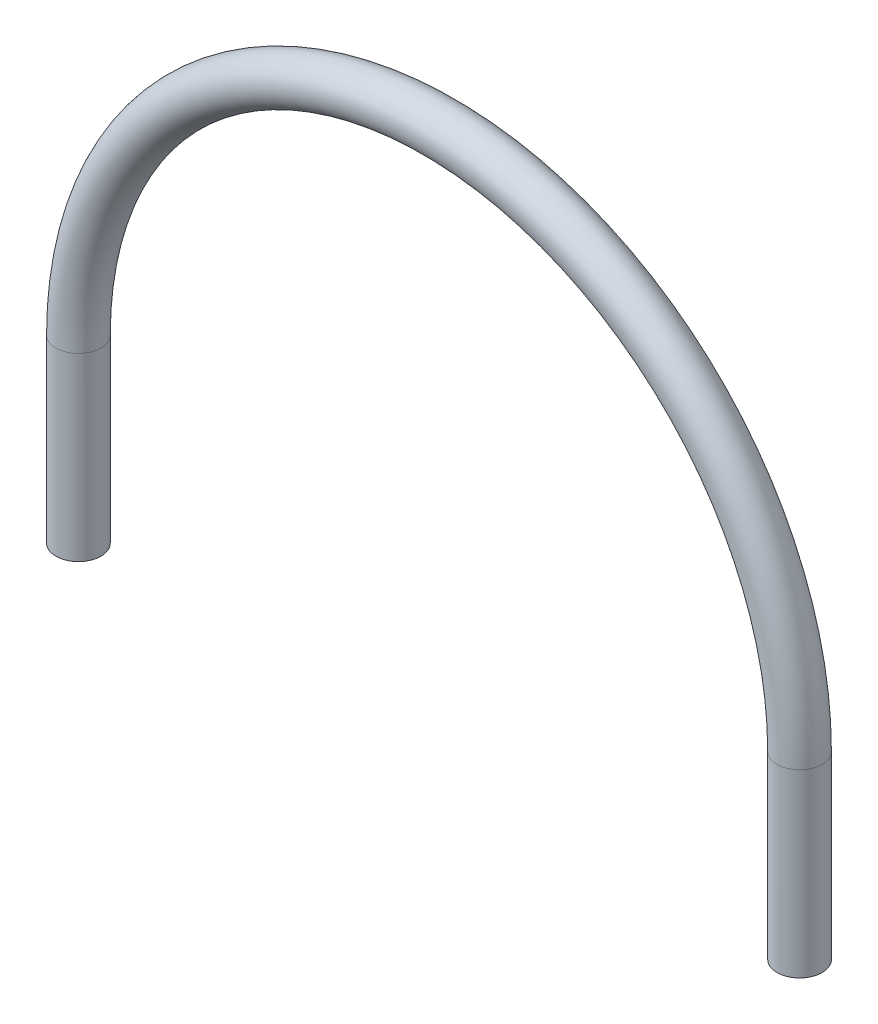
ISO-10303-21;
HEADER;
FILE_DESCRIPTION(('STEP AP214'),'2;1');
FILE_NAME('part.step','',(''),(''),'','','');
FILE_SCHEMA(('AUTOMOTIVE_DESIGN { 1 0 10303 214 1 1 1 1 }'));
ENDSEC;
DATA;
#1=APPLICATION_CONTEXT('core data for automotive mechanical design processes');
#2=APPLICATION_PROTOCOL_DEFINITION('international standard','automotive_design',2000,#1);
#3=PRODUCT_CONTEXT('',#1,'mechanical');
#4=PRODUCT('Part','Part','',(#3));
#5=PRODUCT_RELATED_PRODUCT_CATEGORY('part','',(#4));
#6=PRODUCT_DEFINITION_FORMATION('','',#4);
#7=PRODUCT_DEFINITION_CONTEXT('part definition',#1,'design');
#8=PRODUCT_DEFINITION('design','',#6,#7);
#9=PRODUCT_DEFINITION_SHAPE('','',#8);
#10=(LENGTH_UNIT() NAMED_UNIT(*) SI_UNIT(.MILLI.,.METRE.));
#11=(NAMED_UNIT(*) PLANE_ANGLE_UNIT() SI_UNIT($,.RADIAN.));
#12=(NAMED_UNIT(*) SI_UNIT($,.STERADIAN.) SOLID_ANGLE_UNIT());
#13=UNCERTAINTY_MEASURE_WITH_UNIT(LENGTH_MEASURE(1.E-05),#10,'distance_accuracy_value','');
#14=(GEOMETRIC_REPRESENTATION_CONTEXT(3) GLOBAL_UNCERTAINTY_ASSIGNED_CONTEXT((#13)) GLOBAL_UNIT_ASSIGNED_CONTEXT((#10,
#11,#12)) REPRESENTATION_CONTEXT('',''));
#15=CARTESIAN_POINT('',(0.,0.,0.));
#16=DIRECTION('',(0.,0.,1.));
#17=DIRECTION('',(1.,0.,0.));
#18=AXIS2_PLACEMENT_3D('',#15,#16,#17);
#19=CARTESIAN_POINT('',(0.,0.,0.));
#20=DIRECTION('',(0.,0.,1.));
#21=DIRECTION('',(1.,0.,0.));
#22=AXIS2_PLACEMENT_3D('',#19,#20,#21);
#23=TOROIDAL_SURFACE('',#22,50.8,3.175);
#24=CARTESIAN_POINT('',(50.8,3.67176915505799E-13,0.));
#25=DIRECTION('',(0.,-1.,0.));
#26=DIRECTION('',(0.,0.,1.));
#27=AXIS2_PLACEMENT_3D('',#24,#25,#26);
#28=CIRCLE('',#27,3.175);
#29=CARTESIAN_POINT('',(53.975,3.90125472724912E-13,0.));
#30=VERTEX_POINT('',#29);
#31=EDGE_CURVE('E10',#30,#30,#28,.T.);
#32=CARTESIAN_POINT('',(-50.8,0.,0.));
#33=DIRECTION('',(0.,1.,0.));
#34=DIRECTION('',(0.,0.,1.));
#35=AXIS2_PLACEMENT_3D('',#32,#33,#34);
#36=CIRCLE('',#35,3.175);
#37=CARTESIAN_POINT('',(-53.975,0.,0.));
#38=VERTEX_POINT('',#37);
#39=EDGE_CURVE('E37',#38,#38,#36,.T.);
#40=CARTESIAN_POINT('',(0.,0.,0.));
#41=DIRECTION('',(0.,0.,1.));
#42=DIRECTION('',(1.,0.,0.));
#43=AXIS2_PLACEMENT_3D('',#40,#41,#42);
#44=CIRCLE('',#43,53.975);
#45=EDGE_CURVE('',#30,#38,#44,.T.);
#46=ORIENTED_EDGE('',*,*,#31,.F.);
#47=ORIENTED_EDGE('',*,*,#39,.T.);
#48=ORIENTED_EDGE('',*,*,#45,.T.);
#49=ORIENTED_EDGE('',*,*,#45,.F.);
#50=EDGE_LOOP('',(#46,#48,#47,#49));
#51=FACE_BOUND('',#50,.T.);
#52=ADVANCED_FACE('F31',(#51),#23,.T.);
#53=CARTESIAN_POINT('',(-50.8,-25.4,0.));
#54=DIRECTION('',(0.,1.,0.));
#55=DIRECTION('',(0.,0.,1.));
#56=AXIS2_PLACEMENT_3D('',#53,#54,#55);
#57=CYLINDRICAL_SURFACE('',#56,3.175);
#58=CARTESIAN_POINT('',(-50.8,-25.4,0.));
#59=DIRECTION('',(0.,-1.,0.));
#60=DIRECTION('',(0.,0.,-1.));
#61=AXIS2_PLACEMENT_3D('',#58,#59,#60);
#62=CIRCLE('',#61,3.175);
#63=CARTESIAN_POINT('',(-50.8,-25.4,-3.175));
#64=VERTEX_POINT('',#63);
#65=EDGE_CURVE('E41',#64,#64,#62,.T.);
#66=ORIENTED_EDGE('',*,*,#65,.F.);
#67=EDGE_LOOP('',(#66));
#68=FACE_BOUND('',#67,.T.);
#69=ORIENTED_EDGE('',*,*,#39,.F.);
#70=EDGE_LOOP('',(#69));
#71=FACE_BOUND('',#70,.T.);
#72=ADVANCED_FACE('F62',(#68,#71),#57,.T.);
#73=CARTESIAN_POINT('',(-50.8,-25.4,0.));
#74=DIRECTION('',(0.,-1.,0.));
#75=DIRECTION('',(0.,0.,-1.));
#76=AXIS2_PLACEMENT_3D('',#73,#74,#75);
#77=PLANE('',#76);
#78=ORIENTED_EDGE('',*,*,#65,.T.);
#79=EDGE_LOOP('',(#78));
#80=FACE_BOUND('',#79,.T.);
#81=ADVANCED_FACE('F55',(#80),#77,.T.);
#82=CARTESIAN_POINT('',(50.8,-25.4,0.));
#83=DIRECTION('',(0.,1.,0.));
#84=DIRECTION('',(0.,0.,1.));
#85=AXIS2_PLACEMENT_3D('',#82,#83,#84);
#86=CYLINDRICAL_SURFACE('',#85,3.175);
#87=CARTESIAN_POINT('',(50.8,-25.4,0.));
#88=DIRECTION('',(0.,-1.,0.));
#89=DIRECTION('',(0.,0.,-1.));
#90=AXIS2_PLACEMENT_3D('',#87,#88,#89);
#91=CIRCLE('',#90,3.175);
#92=CARTESIAN_POINT('',(50.8,-25.4,-3.175));
#93=VERTEX_POINT('',#92);
#94=EDGE_CURVE('E45',#93,#93,#91,.T.);
#95=ORIENTED_EDGE('',*,*,#94,.F.);
#96=EDGE_LOOP('',(#95));
#97=FACE_BOUND('',#96,.T.);
#98=ORIENTED_EDGE('',*,*,#31,.T.);
#99=EDGE_LOOP('',(#98));
#100=FACE_BOUND('',#99,.T.);
#101=ADVANCED_FACE('F53',(#97,#100),#86,.T.);
#102=CARTESIAN_POINT('',(50.8,-25.4,0.));
#103=DIRECTION('',(0.,-1.,0.));
#104=DIRECTION('',(0.,0.,-1.));
#105=AXIS2_PLACEMENT_3D('',#102,#103,#104);
#106=PLANE('',#105);
#107=ORIENTED_EDGE('',*,*,#94,.T.);
#108=EDGE_LOOP('',(#107));
#109=FACE_BOUND('',#108,.T.);
#110=ADVANCED_FACE('F51',(#109),#106,.T.);
#111=CLOSED_SHELL('',(#52,#72,#81,#101,#110));
#112=MANIFOLD_SOLID_BREP('B2',#111);
#113=ADVANCED_BREP_SHAPE_REPRESENTATION('',(#18,#112),#14);
#114=SHAPE_DEFINITION_REPRESENTATION(#9,#113);
ENDSEC;
END-ISO-10303-21;
